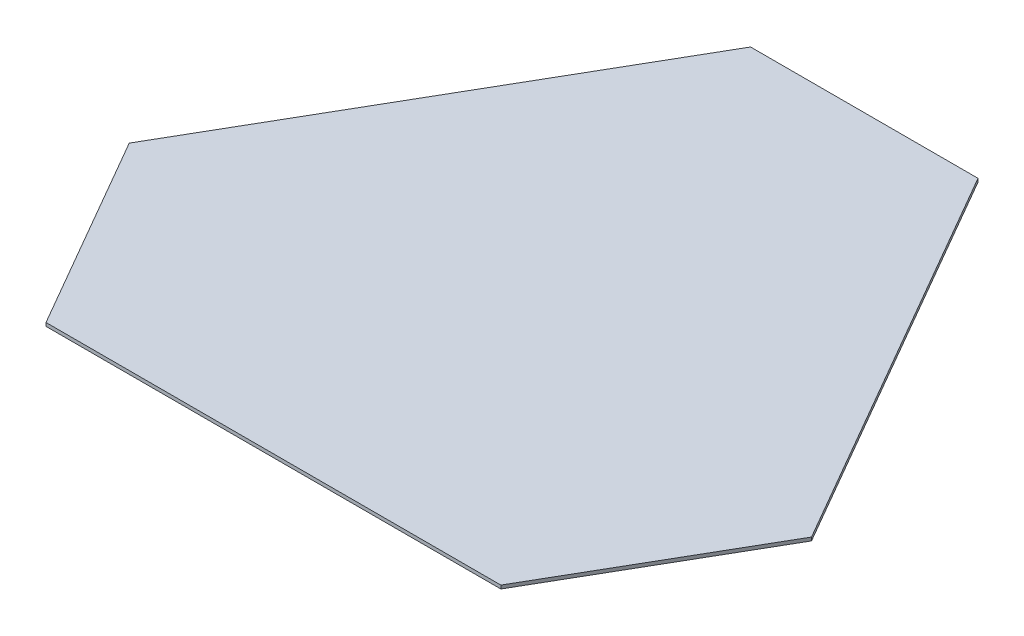
ISO-10303-21;
HEADER;
FILE_DESCRIPTION(('STEP AP214'),'2;1');
FILE_NAME('part.step','',(''),(''),'','','');
FILE_SCHEMA(('AUTOMOTIVE_DESIGN { 1 0 10303 214 1 1 1 1 }'));
ENDSEC;
DATA;
#1=APPLICATION_CONTEXT('core data for automotive mechanical design processes');
#2=APPLICATION_PROTOCOL_DEFINITION('international standard','automotive_design',2000,#1);
#3=PRODUCT_CONTEXT('',#1,'mechanical');
#4=PRODUCT('Part','Part','',(#3));
#5=PRODUCT_RELATED_PRODUCT_CATEGORY('part','',(#4));
#6=PRODUCT_DEFINITION_FORMATION('','',#4);
#7=PRODUCT_DEFINITION_CONTEXT('part definition',#1,'design');
#8=PRODUCT_DEFINITION('design','',#6,#7);
#9=PRODUCT_DEFINITION_SHAPE('','',#8);
#10=(LENGTH_UNIT() NAMED_UNIT(*) SI_UNIT(.MILLI.,.METRE.));
#11=(NAMED_UNIT(*) PLANE_ANGLE_UNIT() SI_UNIT($,.RADIAN.));
#12=(NAMED_UNIT(*) SI_UNIT($,.STERADIAN.) SOLID_ANGLE_UNIT());
#13=UNCERTAINTY_MEASURE_WITH_UNIT(LENGTH_MEASURE(1.E-05),#10,'distance_accuracy_value','');
#14=(GEOMETRIC_REPRESENTATION_CONTEXT(3) GLOBAL_UNCERTAINTY_ASSIGNED_CONTEXT((#13)) GLOBAL_UNIT_ASSIGNED_CONTEXT((#10,
#11,#12)) REPRESENTATION_CONTEXT('',''));
#15=CARTESIAN_POINT('',(0.,0.,0.));
#16=DIRECTION('',(0.,0.,1.));
#17=DIRECTION('',(1.,0.,0.));
#18=AXIS2_PLACEMENT_3D('',#15,#16,#17);
#19=CARTESIAN_POINT('',(-250.,3.,144.337567297404));
#20=DIRECTION('',(-0.866025403784442,0.,0.499999999999993));
#21=DIRECTION('',(0.499999999999993,0.,0.866025403784443));
#22=AXIS2_PLACEMENT_3D('',#19,#20,#21);
#23=PLANE('',#22);
#24=DIRECTION('',(-0.499999999999993,0.,-0.866025403784442));
#25=VECTOR('',#24,1.);
#26=CARTESIAN_POINT('',(-250.,0.,144.337567297404));
#27=LINE('',#26,#25);
#28=CARTESIAN_POINT('',(-200.000000000001,0.,230.940107675847));
#29=VERTEX_POINT('',#28);
#30=CARTESIAN_POINT('',(-299.999999999999,0.,57.7350269189589));
#31=VERTEX_POINT('',#30);
#32=EDGE_CURVE('E119',#29,#31,#27,.T.);
#33=ORIENTED_EDGE('',*,*,#32,.F.);
#34=DIRECTION('',(0.,-1.,0.));
#35=VECTOR('',#34,1.);
#36=CARTESIAN_POINT('',(-200.000000000001,3.,230.940107675847));
#37=LINE('',#36,#35);
#38=CARTESIAN_POINT('',(-200.000000000001,3.,230.940107675847));
#39=VERTEX_POINT('',#38);
#40=EDGE_CURVE('E11',#39,#29,#37,.T.);
#41=ORIENTED_EDGE('',*,*,#40,.F.);
#42=DIRECTION('',(-0.499999999999993,0.,-0.866025403784442));
#43=VECTOR('',#42,1.);
#44=CARTESIAN_POINT('',(-250.,3.,144.337567297404));
#45=LINE('',#44,#43);
#46=CARTESIAN_POINT('',(-299.999999999999,3.,57.7350269189589));
#47=VERTEX_POINT('',#46);
#48=EDGE_CURVE('E133',#39,#47,#45,.T.);
#49=ORIENTED_EDGE('',*,*,#48,.T.);
#50=DIRECTION('',(0.,-1.,0.));
#51=VECTOR('',#50,1.);
#52=CARTESIAN_POINT('',(-299.999999999999,3.,57.7350269189589));
#53=LINE('',#52,#51);
#54=EDGE_CURVE('E54',#47,#31,#53,.T.);
#55=ORIENTED_EDGE('',*,*,#54,.T.);
#56=EDGE_LOOP('',(#33,#41,#49,#55));
#57=FACE_BOUND('',#56,.T.);
#58=ADVANCED_FACE('F38',(#57),#23,.T.);
#59=CARTESIAN_POINT('',(0.,3.,230.940107675847));
#60=DIRECTION('',(0.,0.,1.));
#61=DIRECTION('',(1.,0.,0.));
#62=AXIS2_PLACEMENT_3D('',#59,#60,#61);
#63=PLANE('',#62);
#64=DIRECTION('',(-1.,0.,0.));
#65=VECTOR('',#64,1.);
#66=CARTESIAN_POINT('',(0.,0.,230.940107675847));
#67=LINE('',#66,#65);
#68=CARTESIAN_POINT('',(199.999999999999,0.,230.940107675847));
#69=VERTEX_POINT('',#68);
#70=EDGE_CURVE('E121',#69,#29,#67,.T.);
#71=ORIENTED_EDGE('',*,*,#70,.F.);
#72=DIRECTION('',(0.,-1.,0.));
#73=VECTOR('',#72,1.);
#74=CARTESIAN_POINT('',(199.999999999999,3.,230.940107675847));
#75=LINE('',#74,#73);
#76=CARTESIAN_POINT('',(199.999999999999,3.,230.940107675847));
#77=VERTEX_POINT('',#76);
#78=EDGE_CURVE('E46',#77,#69,#75,.T.);
#79=ORIENTED_EDGE('',*,*,#78,.F.);
#80=DIRECTION('',(-1.,0.,0.));
#81=VECTOR('',#80,1.);
#82=CARTESIAN_POINT('',(0.,3.,230.940107675847));
#83=LINE('',#82,#81);
#84=EDGE_CURVE('E214',#77,#39,#83,.T.);
#85=ORIENTED_EDGE('',*,*,#84,.T.);
#86=ORIENTED_EDGE('',*,*,#40,.T.);
#87=EDGE_LOOP('',(#71,#79,#85,#86));
#88=FACE_BOUND('',#87,.T.);
#89=ADVANCED_FACE('F142',(#88),#63,.T.);
#90=CARTESIAN_POINT('',(249.999999999999,3.,144.337567297398));
#91=DIRECTION('',(0.866025403784451,0.,0.499999999999978));
#92=DIRECTION('',(0.499999999999978,0.,-0.866025403784451));
#93=AXIS2_PLACEMENT_3D('',#90,#91,#92);
#94=PLANE('',#93);
#95=DIRECTION('',(-0.499999999999978,0.,0.866025403784451));
#96=VECTOR('',#95,1.);
#97=CARTESIAN_POINT('',(249.999999999999,0.,144.337567297398));
#98=LINE('',#97,#96);
#99=CARTESIAN_POINT('',(299.999999999995,0.,57.735026918956));
#100=VERTEX_POINT('',#99);
#101=EDGE_CURVE('E124',#100,#69,#98,.T.);
#102=ORIENTED_EDGE('',*,*,#101,.F.);
#103=DIRECTION('',(0.,-1.,0.));
#104=VECTOR('',#103,1.);
#105=CARTESIAN_POINT('',(299.999999999995,3.,57.735026918956));
#106=LINE('',#105,#104);
#107=CARTESIAN_POINT('',(299.999999999995,3.,57.735026918956));
#108=VERTEX_POINT('',#107);
#109=EDGE_CURVE('E101',#108,#100,#106,.T.);
#110=ORIENTED_EDGE('',*,*,#109,.F.);
#111=DIRECTION('',(-0.499999999999978,0.,0.866025403784451));
#112=VECTOR('',#111,1.);
#113=CARTESIAN_POINT('',(249.999999999999,3.,144.337567297398));
#114=LINE('',#113,#112);
#115=EDGE_CURVE('E111',#108,#77,#114,.T.);
#116=ORIENTED_EDGE('',*,*,#115,.T.);
#117=ORIENTED_EDGE('',*,*,#78,.T.);
#118=EDGE_LOOP('',(#102,#110,#116,#117));
#119=FACE_BOUND('',#118,.T.);
#120=ADVANCED_FACE('F139',(#119),#94,.T.);
#121=CARTESIAN_POINT('',(200.000000000001,3.,-115.470053837924));
#122=DIRECTION('',(0.866025403784442,0.,-0.499999999999993));
#123=DIRECTION('',(-0.499999999999993,0.,-0.866025403784443));
#124=AXIS2_PLACEMENT_3D('',#121,#122,#123);
#125=PLANE('',#124);
#126=DIRECTION('',(0.499999999999993,0.,0.866025403784443));
#127=VECTOR('',#126,1.);
#128=CARTESIAN_POINT('',(200.000000000001,0.,-115.470053837924));
#129=LINE('',#128,#127);
#130=CARTESIAN_POINT('',(100.,0.,-288.675134594817));
#131=VERTEX_POINT('',#130);
#132=EDGE_CURVE('E97',#131,#100,#129,.T.);
#133=ORIENTED_EDGE('',*,*,#132,.F.);
#134=DIRECTION('',(0.,-1.,0.));
#135=VECTOR('',#134,1.);
#136=CARTESIAN_POINT('',(100.,3.,-288.675134594817));
#137=LINE('',#136,#135);
#138=CARTESIAN_POINT('',(100.,3.,-288.675134594817));
#139=VERTEX_POINT('',#138);
#140=EDGE_CURVE('E92',#139,#131,#137,.T.);
#141=ORIENTED_EDGE('',*,*,#140,.F.);
#142=DIRECTION('',(0.499999999999993,0.,0.866025403784443));
#143=VECTOR('',#142,1.);
#144=CARTESIAN_POINT('',(200.000000000001,3.,-115.470053837924));
#145=LINE('',#144,#143);
#146=EDGE_CURVE('E95',#139,#108,#145,.T.);
#147=ORIENTED_EDGE('',*,*,#146,.T.);
#148=ORIENTED_EDGE('',*,*,#109,.T.);
#149=EDGE_LOOP('',(#133,#141,#147,#148));
#150=FACE_BOUND('',#149,.T.);
#151=ADVANCED_FACE('F94',(#150),#125,.T.);
#152=CARTESIAN_POINT('',(0.,3.,-288.675134594817));
#153=DIRECTION('',(0.,0.,-1.));
#154=DIRECTION('',(-1.,0.,0.));
#155=AXIS2_PLACEMENT_3D('',#152,#153,#154);
#156=PLANE('',#155);
#157=DIRECTION('',(1.,0.,0.));
#158=VECTOR('',#157,1.);
#159=CARTESIAN_POINT('',(0.,0.,-288.675134594817));
#160=LINE('',#159,#158);
#161=CARTESIAN_POINT('',(-100.,0.,-288.675134594817));
#162=VERTEX_POINT('',#161);
#163=EDGE_CURVE('E128',#162,#131,#160,.T.);
#164=ORIENTED_EDGE('',*,*,#163,.F.);
#165=DIRECTION('',(0.,-1.,0.));
#166=VECTOR('',#165,1.);
#167=CARTESIAN_POINT('',(-100.,3.,-288.675134594817));
#168=LINE('',#167,#166);
#169=CARTESIAN_POINT('',(-100.,3.,-288.675134594817));
#170=VERTEX_POINT('',#169);
#171=EDGE_CURVE('E73',#170,#162,#168,.T.);
#172=ORIENTED_EDGE('',*,*,#171,.F.);
#173=DIRECTION('',(1.,0.,0.));
#174=VECTOR('',#173,1.);
#175=CARTESIAN_POINT('',(0.,3.,-288.675134594817));
#176=LINE('',#175,#174);
#177=EDGE_CURVE('E108',#170,#139,#176,.T.);
#178=ORIENTED_EDGE('',*,*,#177,.T.);
#179=ORIENTED_EDGE('',*,*,#140,.T.);
#180=EDGE_LOOP('',(#164,#172,#178,#179));
#181=FACE_BOUND('',#180,.T.);
#182=ADVANCED_FACE('F113',(#181),#156,.T.);
#183=CARTESIAN_POINT('',(-200.000000000002,3.,-115.470053837925));
#184=DIRECTION('',(-0.86602540378444,0.,-0.499999999999998));
#185=DIRECTION('',(-0.499999999999998,0.,0.86602540378444));
#186=AXIS2_PLACEMENT_3D('',#183,#184,#185);
#187=PLANE('',#186);
#188=DIRECTION('',(0.499999999999998,0.,-0.86602540378444));
#189=VECTOR('',#188,1.);
#190=CARTESIAN_POINT('',(-200.000000000002,0.,-115.470053837925));
#191=LINE('',#190,#189);
#192=EDGE_CURVE('E130',#31,#162,#191,.T.);
#193=ORIENTED_EDGE('',*,*,#192,.F.);
#194=ORIENTED_EDGE('',*,*,#54,.F.);
#195=DIRECTION('',(0.499999999999998,0.,-0.86602540378444));
#196=VECTOR('',#195,1.);
#197=CARTESIAN_POINT('',(-200.000000000002,3.,-115.470053837925));
#198=LINE('',#197,#196);
#199=EDGE_CURVE('E114',#47,#170,#198,.T.);
#200=ORIENTED_EDGE('',*,*,#199,.T.);
#201=ORIENTED_EDGE('',*,*,#171,.T.);
#202=EDGE_LOOP('',(#193,#194,#200,#201));
#203=FACE_BOUND('',#202,.T.);
#204=ADVANCED_FACE('F145',(#203),#187,.T.);
#205=CARTESIAN_POINT('',(0.,3.,0.));
#206=DIRECTION('',(0.,1.,0.));
#207=DIRECTION('',(0.,0.,1.));
#208=AXIS2_PLACEMENT_3D('',#205,#206,#207);
#209=PLANE('',#208);
#210=ORIENTED_EDGE('',*,*,#48,.F.);
#211=ORIENTED_EDGE('',*,*,#84,.F.);
#212=ORIENTED_EDGE('',*,*,#115,.F.);
#213=ORIENTED_EDGE('',*,*,#146,.F.);
#214=ORIENTED_EDGE('',*,*,#177,.F.);
#215=ORIENTED_EDGE('',*,*,#199,.F.);
#216=EDGE_LOOP('',(#210,#211,#212,#213,#214,#215));
#217=FACE_BOUND('',#216,.T.);
#218=ADVANCED_FACE('F106',(#217),#209,.T.);
#219=CARTESIAN_POINT('',(0.,0.,0.));
#220=DIRECTION('',(0.,1.,0.));
#221=DIRECTION('',(0.,0.,1.));
#222=AXIS2_PLACEMENT_3D('',#219,#220,#221);
#223=PLANE('',#222);
#224=ORIENTED_EDGE('',*,*,#32,.T.);
#225=ORIENTED_EDGE('',*,*,#192,.T.);
#226=ORIENTED_EDGE('',*,*,#163,.T.);
#227=ORIENTED_EDGE('',*,*,#132,.T.);
#228=ORIENTED_EDGE('',*,*,#101,.T.);
#229=ORIENTED_EDGE('',*,*,#70,.T.);
#230=EDGE_LOOP('',(#224,#225,#226,#227,#228,#229));
#231=FACE_BOUND('',#230,.T.);
#232=ADVANCED_FACE('F144',(#231),#223,.F.);
#233=CLOSED_SHELL('',(#58,#89,#120,#151,#182,#204,#218,#232));
#234=MANIFOLD_SOLID_BREP('B2',#233);
#235=ADVANCED_BREP_SHAPE_REPRESENTATION('',(#18,#234),#14);
#236=SHAPE_DEFINITION_REPRESENTATION(#9,#235);
ENDSEC;
END-ISO-10303-21;
